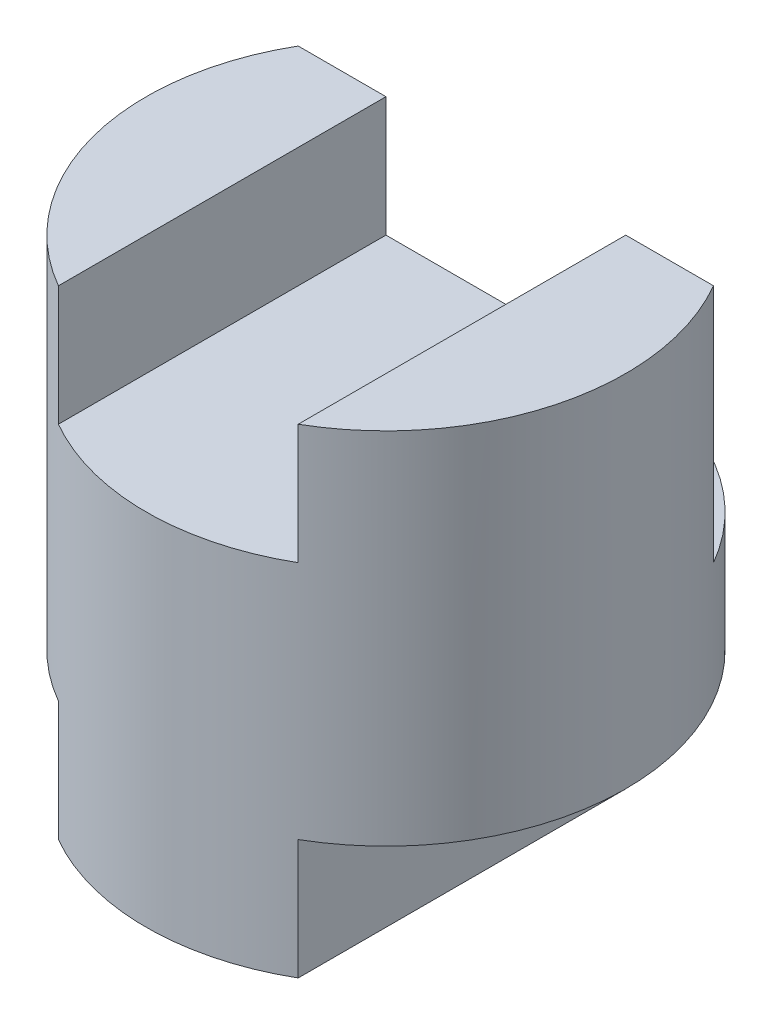
ISO-10303-21;
HEADER;
FILE_DESCRIPTION(('STEP AP214'),'2;1');
FILE_NAME('part.step','',(''),(''),'','','');
FILE_SCHEMA(('AUTOMOTIVE_DESIGN { 1 0 10303 214 1 1 1 1 }'));
ENDSEC;
DATA;
#1=APPLICATION_CONTEXT('core data for automotive mechanical design processes');
#2=APPLICATION_PROTOCOL_DEFINITION('international standard','automotive_design',2000,#1);
#3=PRODUCT_CONTEXT('',#1,'mechanical');
#4=PRODUCT('Part','Part','',(#3));
#5=PRODUCT_RELATED_PRODUCT_CATEGORY('part','',(#4));
#6=PRODUCT_DEFINITION_FORMATION('','',#4);
#7=PRODUCT_DEFINITION_CONTEXT('part definition',#1,'design');
#8=PRODUCT_DEFINITION('design','',#6,#7);
#9=PRODUCT_DEFINITION_SHAPE('','',#8);
#10=(LENGTH_UNIT() NAMED_UNIT(*) SI_UNIT(.MILLI.,.METRE.));
#11=(NAMED_UNIT(*) PLANE_ANGLE_UNIT() SI_UNIT($,.RADIAN.));
#12=(NAMED_UNIT(*) SI_UNIT($,.STERADIAN.) SOLID_ANGLE_UNIT());
#13=UNCERTAINTY_MEASURE_WITH_UNIT(LENGTH_MEASURE(1.E-05),#10,'distance_accuracy_value','');
#14=(GEOMETRIC_REPRESENTATION_CONTEXT(3) GLOBAL_UNCERTAINTY_ASSIGNED_CONTEXT((#13)) GLOBAL_UNIT_ASSIGNED_CONTEXT((#10,
#11,#12)) REPRESENTATION_CONTEXT('',''));
#15=CARTESIAN_POINT('',(0.,0.,0.));
#16=DIRECTION('',(0.,0.,1.));
#17=DIRECTION('',(1.,0.,0.));
#18=AXIS2_PLACEMENT_3D('',#15,#16,#17);
#19=CARTESIAN_POINT('',(0.,4.,0.));
#20=DIRECTION('',(0.,-1.,0.));
#21=DIRECTION('',(0.,0.,-1.));
#22=AXIS2_PLACEMENT_3D('',#19,#20,#21);
#23=CYLINDRICAL_SURFACE('',#22,2.);
#24=CARTESIAN_POINT('',(0.,4.,0.));
#25=DIRECTION('',(0.,1.,0.));
#26=DIRECTION('',(0.,0.,1.));
#27=AXIS2_PLACEMENT_3D('',#24,#25,#26);
#28=CIRCLE('',#27,2.);
#29=CARTESIAN_POINT('',(-1.73205080756888,4.,-1.));
#30=VERTEX_POINT('',#29);
#31=CARTESIAN_POINT('',(-1.,4.,1.73205080756888));
#32=VERTEX_POINT('',#31);
#33=EDGE_CURVE('E166',#30,#32,#28,.T.);
#34=ORIENTED_EDGE('',*,*,#33,.F.);
#35=DIRECTION('',(0.,1.,0.));
#36=VECTOR('',#35,1.);
#37=CARTESIAN_POINT('',(-1.73205080756888,2.,-1.));
#38=LINE('',#37,#36);
#39=CARTESIAN_POINT('',(-1.73205080756888,2.,-1.));
#40=VERTEX_POINT('',#39);
#41=EDGE_CURVE('E190',#40,#30,#38,.T.);
#42=ORIENTED_EDGE('',*,*,#41,.F.);
#43=CARTESIAN_POINT('',(0.,2.,0.));
#44=DIRECTION('',(0.,1.,0.));
#45=DIRECTION('',(0.,0.,-1.));
#46=AXIS2_PLACEMENT_3D('',#43,#44,#45);
#47=CIRCLE('',#46,2.);
#48=CARTESIAN_POINT('',(1.73205080756888,2.,-1.));
#49=VERTEX_POINT('',#48);
#50=EDGE_CURVE('E184',#49,#40,#47,.T.);
#51=ORIENTED_EDGE('',*,*,#50,.F.);
#52=DIRECTION('',(0.,1.,0.));
#53=VECTOR('',#52,1.);
#54=CARTESIAN_POINT('',(1.73205080756888,2.,-1.));
#55=LINE('',#54,#53);
#56=CARTESIAN_POINT('',(1.73205080756888,4.,-1.));
#57=VERTEX_POINT('',#56);
#58=EDGE_CURVE('E165',#49,#57,#55,.T.);
#59=ORIENTED_EDGE('',*,*,#58,.T.);
#60=CARTESIAN_POINT('',(1.,4.,1.73205080756888));
#61=VERTEX_POINT('',#60);
#62=EDGE_CURVE('E134',#61,#57,#28,.T.);
#63=ORIENTED_EDGE('',*,*,#62,.F.);
#64=DIRECTION('',(0.,-1.,0.));
#65=VECTOR('',#64,1.);
#66=CARTESIAN_POINT('',(1.,4.,1.73205080756888));
#67=LINE('',#66,#65);
#68=CARTESIAN_POINT('',(1.,3.,1.73205080756888));
#69=VERTEX_POINT('',#68);
#70=EDGE_CURVE('E156',#69,#61,#67,.F.);
#71=ORIENTED_EDGE('',*,*,#70,.F.);
#72=CARTESIAN_POINT('',(0.,3.,0.));
#73=DIRECTION('',(0.,1.,0.));
#74=DIRECTION('',(-1.,0.,0.));
#75=AXIS2_PLACEMENT_3D('',#72,#73,#74);
#76=CIRCLE('',#75,2.);
#77=CARTESIAN_POINT('',(-1.,3.,1.73205080756888));
#78=VERTEX_POINT('',#77);
#79=EDGE_CURVE('E142',#78,#69,#76,.T.);
#80=ORIENTED_EDGE('',*,*,#79,.F.);
#81=DIRECTION('',(0.,-1.,0.));
#82=VECTOR('',#81,1.);
#83=CARTESIAN_POINT('',(-1.,4.,1.73205080756888));
#84=LINE('',#83,#82);
#85=EDGE_CURVE('E160',#78,#32,#84,.F.);
#86=ORIENTED_EDGE('',*,*,#85,.T.);
#87=EDGE_LOOP('',(#34,#42,#51,#59,#63,#71,#80,#86));
#88=FACE_BOUND('',#87,.T.);
#89=DIRECTION('',(0.,-1.,0.));
#90=VECTOR('',#89,1.);
#91=CARTESIAN_POINT('',(1.,4.,1.73205080756888));
#92=LINE('',#91,#90);
#93=CARTESIAN_POINT('',(1.,1.,1.73205080756888));
#94=VERTEX_POINT('',#93);
#95=CARTESIAN_POINT('',(1.,0.,1.73205080756888));
#96=VERTEX_POINT('',#95);
#97=EDGE_CURVE('E130',#94,#96,#92,.T.);
#98=ORIENTED_EDGE('',*,*,#97,.F.);
#99=CARTESIAN_POINT('',(0.,1.,0.));
#100=DIRECTION('',(0.,-1.,0.));
#101=DIRECTION('',(0.,0.,-1.));
#102=AXIS2_PLACEMENT_3D('',#99,#100,#101);
#103=CIRCLE('',#102,2.);
#104=CARTESIAN_POINT('',(-1.,1.,1.73205080756888));
#105=VERTEX_POINT('',#104);
#106=EDGE_CURVE('E140',#105,#94,#103,.T.);
#107=ORIENTED_EDGE('',*,*,#106,.F.);
#108=DIRECTION('',(0.,-1.,0.));
#109=VECTOR('',#108,1.);
#110=CARTESIAN_POINT('',(-1.,4.,1.73205080756888));
#111=LINE('',#110,#109);
#112=CARTESIAN_POINT('',(-1.,0.,1.73205080756888));
#113=VERTEX_POINT('',#112);
#114=EDGE_CURVE('E200',#105,#113,#111,.T.);
#115=ORIENTED_EDGE('',*,*,#114,.T.);
#116=CARTESIAN_POINT('',(0.,0.,0.));
#117=DIRECTION('',(0.,1.,0.));
#118=DIRECTION('',(0.,0.,1.));
#119=AXIS2_PLACEMENT_3D('',#116,#117,#118);
#120=CIRCLE('',#119,2.);
#121=EDGE_CURVE('E168',#113,#96,#120,.T.);
#122=ORIENTED_EDGE('',*,*,#121,.T.);
#123=EDGE_LOOP('',(#98,#107,#115,#122));
#124=FACE_BOUND('',#123,.T.);
#125=ADVANCED_FACE('F33',(#88,#124),#23,.T.);
#126=CARTESIAN_POINT('',(0.,4.,0.));
#127=DIRECTION('',(0.,1.,0.));
#128=DIRECTION('',(0.,0.,1.));
#129=AXIS2_PLACEMENT_3D('',#126,#127,#128);
#130=PLANE('',#129);
#131=DIRECTION('',(1.,0.,0.));
#132=VECTOR('',#131,1.);
#133=CARTESIAN_POINT('',(1.73205080756888,4.,-1.));
#134=LINE('',#133,#132);
#135=CARTESIAN_POINT('',(1.,4.,-1.));
#136=VERTEX_POINT('',#135);
#137=EDGE_CURVE('E145',#136,#57,#134,.T.);
#138=ORIENTED_EDGE('',*,*,#137,.F.);
#139=DIRECTION('',(0.,0.,1.));
#140=VECTOR('',#139,1.);
#141=CARTESIAN_POINT('',(1.,4.,0.));
#142=LINE('',#141,#140);
#143=EDGE_CURVE('E55',#136,#61,#142,.T.);
#144=ORIENTED_EDGE('',*,*,#143,.T.);
#145=ORIENTED_EDGE('',*,*,#62,.T.);
#146=EDGE_LOOP('',(#138,#144,#145));
#147=FACE_BOUND('',#146,.T.);
#148=ADVANCED_FACE('F149',(#147),#130,.T.);
#149=CARTESIAN_POINT('',(0.,0.,0.));
#150=DIRECTION('',(0.,1.,0.));
#151=DIRECTION('',(0.,0.,1.));
#152=AXIS2_PLACEMENT_3D('',#149,#150,#151);
#153=PLANE('',#152);
#154=DIRECTION('',(0.,0.,-1.));
#155=VECTOR('',#154,1.);
#156=CARTESIAN_POINT('',(-1.,0.,0.));
#157=LINE('',#156,#155);
#158=CARTESIAN_POINT('',(-1.,0.,-1.));
#159=VERTEX_POINT('',#158);
#160=EDGE_CURVE('E126',#113,#159,#157,.T.);
#161=ORIENTED_EDGE('',*,*,#160,.T.);
#162=DIRECTION('',(-1.,0.,0.));
#163=VECTOR('',#162,1.);
#164=CARTESIAN_POINT('',(1.73205080756888,0.,-1.));
#165=LINE('',#164,#163);
#166=CARTESIAN_POINT('',(1.,0.,-1.));
#167=VERTEX_POINT('',#166);
#168=EDGE_CURVE('E111',#167,#159,#165,.T.);
#169=ORIENTED_EDGE('',*,*,#168,.F.);
#170=DIRECTION('',(0.,0.,-1.));
#171=VECTOR('',#170,1.);
#172=CARTESIAN_POINT('',(1.,0.,0.));
#173=LINE('',#172,#171);
#174=EDGE_CURVE('E124',#96,#167,#173,.T.);
#175=ORIENTED_EDGE('',*,*,#174,.F.);
#176=ORIENTED_EDGE('',*,*,#121,.F.);
#177=EDGE_LOOP('',(#161,#169,#175,#176));
#178=FACE_BOUND('',#177,.T.);
#179=ADVANCED_FACE('F122',(#178),#153,.F.);
#180=CARTESIAN_POINT('',(-1.,4.,-1.));
#181=VERTEX_POINT('',#180);
#182=EDGE_CURVE('E151',#30,#181,#134,.T.);
#183=ORIENTED_EDGE('',*,*,#182,.F.);
#184=ORIENTED_EDGE('',*,*,#33,.T.);
#185=DIRECTION('',(0.,0.,1.));
#186=VECTOR('',#185,1.);
#187=CARTESIAN_POINT('',(-1.,4.,0.));
#188=LINE('',#187,#186);
#189=EDGE_CURVE('E132',#181,#32,#188,.T.);
#190=ORIENTED_EDGE('',*,*,#189,.F.);
#191=EDGE_LOOP('',(#183,#184,#190));
#192=FACE_BOUND('',#191,.T.);
#193=ADVANCED_FACE('F183',(#192),#130,.T.);
#194=CARTESIAN_POINT('',(-1.,0.,-5.));
#195=DIRECTION('',(1.,0.,0.));
#196=DIRECTION('',(0.,0.,-1.));
#197=AXIS2_PLACEMENT_3D('',#194,#195,#196);
#198=PLANE('',#197);
#199=DIRECTION('',(0.,0.,1.));
#200=VECTOR('',#199,1.);
#201=CARTESIAN_POINT('',(-1.,1.,-5.));
#202=LINE('',#201,#200);
#203=CARTESIAN_POINT('',(-1.,1.,-1.));
#204=VERTEX_POINT('',#203);
#205=EDGE_CURVE('E196',#204,#105,#202,.T.);
#206=ORIENTED_EDGE('',*,*,#205,.F.);
#207=DIRECTION('',(0.,-1.,0.));
#208=VECTOR('',#207,1.);
#209=CARTESIAN_POINT('',(-1.,0.,-1.));
#210=LINE('',#209,#208);
#211=EDGE_CURVE('E152',#204,#159,#210,.T.);
#212=ORIENTED_EDGE('',*,*,#211,.T.);
#213=ORIENTED_EDGE('',*,*,#160,.F.);
#214=ORIENTED_EDGE('',*,*,#114,.F.);
#215=EDGE_LOOP('',(#206,#212,#213,#214));
#216=FACE_BOUND('',#215,.T.);
#217=ADVANCED_FACE('F206',(#216),#198,.F.);
#218=CARTESIAN_POINT('',(1.,1.,-5.));
#219=DIRECTION('',(0.,-1.,0.));
#220=DIRECTION('',(0.,0.,-1.));
#221=AXIS2_PLACEMENT_3D('',#218,#219,#220);
#222=PLANE('',#221);
#223=DIRECTION('',(0.,0.,1.));
#224=VECTOR('',#223,1.);
#225=CARTESIAN_POINT('',(1.,1.,-5.));
#226=LINE('',#225,#224);
#227=CARTESIAN_POINT('',(1.,1.,-1.));
#228=VERTEX_POINT('',#227);
#229=EDGE_CURVE('E194',#228,#94,#226,.T.);
#230=ORIENTED_EDGE('',*,*,#229,.F.);
#231=DIRECTION('',(-1.,0.,0.));
#232=VECTOR('',#231,1.);
#233=CARTESIAN_POINT('',(1.73205080756888,1.,-1.));
#234=LINE('',#233,#232);
#235=EDGE_CURVE('E114',#228,#204,#234,.T.);
#236=ORIENTED_EDGE('',*,*,#235,.T.);
#237=ORIENTED_EDGE('',*,*,#205,.T.);
#238=ORIENTED_EDGE('',*,*,#106,.T.);
#239=EDGE_LOOP('',(#230,#236,#237,#238));
#240=FACE_BOUND('',#239,.T.);
#241=ADVANCED_FACE('F210',(#240),#222,.T.);
#242=CARTESIAN_POINT('',(1.,0.,-5.));
#243=DIRECTION('',(1.,0.,0.));
#244=DIRECTION('',(0.,0.,-1.));
#245=AXIS2_PLACEMENT_3D('',#242,#243,#244);
#246=PLANE('',#245);
#247=DIRECTION('',(0.,-1.,0.));
#248=VECTOR('',#247,1.);
#249=CARTESIAN_POINT('',(1.,0.,-1.));
#250=LINE('',#249,#248);
#251=EDGE_CURVE('E11',#228,#167,#250,.T.);
#252=ORIENTED_EDGE('',*,*,#251,.F.);
#253=ORIENTED_EDGE('',*,*,#229,.T.);
#254=ORIENTED_EDGE('',*,*,#97,.T.);
#255=ORIENTED_EDGE('',*,*,#174,.T.);
#256=EDGE_LOOP('',(#252,#253,#254,#255));
#257=FACE_BOUND('',#256,.T.);
#258=ADVANCED_FACE('F128',(#257),#246,.T.);
#259=CARTESIAN_POINT('',(1.,3.,-5.));
#260=DIRECTION('',(0.,1.,0.));
#261=DIRECTION('',(-1.,0.,0.));
#262=AXIS2_PLACEMENT_3D('',#259,#260,#261);
#263=PLANE('',#262);
#264=DIRECTION('',(1.,0.,0.));
#265=VECTOR('',#264,1.);
#266=CARTESIAN_POINT('',(1.,3.,-1.));
#267=LINE('',#266,#265);
#268=CARTESIAN_POINT('',(-1.,3.,-1.));
#269=VERTEX_POINT('',#268);
#270=CARTESIAN_POINT('',(1.,3.,-1.));
#271=VERTEX_POINT('',#270);
#272=EDGE_CURVE('E47',#269,#271,#267,.T.);
#273=ORIENTED_EDGE('',*,*,#272,.F.);
#274=DIRECTION('',(0.,0.,1.));
#275=VECTOR('',#274,1.);
#276=CARTESIAN_POINT('',(-1.,3.,-5.));
#277=LINE('',#276,#275);
#278=EDGE_CURVE('E178',#269,#78,#277,.T.);
#279=ORIENTED_EDGE('',*,*,#278,.T.);
#280=ORIENTED_EDGE('',*,*,#79,.T.);
#281=DIRECTION('',(0.,0.,1.));
#282=VECTOR('',#281,1.);
#283=CARTESIAN_POINT('',(1.,3.,-5.));
#284=LINE('',#283,#282);
#285=EDGE_CURVE('E157',#271,#69,#284,.T.);
#286=ORIENTED_EDGE('',*,*,#285,.F.);
#287=EDGE_LOOP('',(#273,#279,#280,#286));
#288=FACE_BOUND('',#287,.T.);
#289=ADVANCED_FACE('F217',(#288),#263,.T.);
#290=CARTESIAN_POINT('',(-1.,4.,-5.));
#291=DIRECTION('',(-1.,0.,0.));
#292=DIRECTION('',(0.,0.,1.));
#293=AXIS2_PLACEMENT_3D('',#290,#291,#292);
#294=PLANE('',#293);
#295=ORIENTED_EDGE('',*,*,#278,.F.);
#296=DIRECTION('',(0.,1.,0.));
#297=VECTOR('',#296,1.);
#298=CARTESIAN_POINT('',(-1.,4.,-1.));
#299=LINE('',#298,#297);
#300=EDGE_CURVE('E180',#269,#181,#299,.T.);
#301=ORIENTED_EDGE('',*,*,#300,.T.);
#302=ORIENTED_EDGE('',*,*,#189,.T.);
#303=ORIENTED_EDGE('',*,*,#85,.F.);
#304=EDGE_LOOP('',(#295,#301,#302,#303));
#305=FACE_BOUND('',#304,.T.);
#306=ADVANCED_FACE('F176',(#305),#294,.F.);
#307=CARTESIAN_POINT('',(1.,4.,-5.));
#308=DIRECTION('',(-1.,0.,0.));
#309=DIRECTION('',(0.,0.,1.));
#310=AXIS2_PLACEMENT_3D('',#307,#308,#309);
#311=PLANE('',#310);
#312=DIRECTION('',(0.,1.,0.));
#313=VECTOR('',#312,1.);
#314=CARTESIAN_POINT('',(1.,4.,-1.));
#315=LINE('',#314,#313);
#316=EDGE_CURVE('E40',#271,#136,#315,.T.);
#317=ORIENTED_EDGE('',*,*,#316,.F.);
#318=ORIENTED_EDGE('',*,*,#285,.T.);
#319=ORIENTED_EDGE('',*,*,#70,.T.);
#320=ORIENTED_EDGE('',*,*,#143,.F.);
#321=EDGE_LOOP('',(#317,#318,#319,#320));
#322=FACE_BOUND('',#321,.T.);
#323=ADVANCED_FACE('F154',(#322),#311,.T.);
#324=CARTESIAN_POINT('',(1.73205080756888,2.,-1.));
#325=DIRECTION('',(0.,0.,1.));
#326=DIRECTION('',(1.,0.,0.));
#327=AXIS2_PLACEMENT_3D('',#324,#325,#326);
#328=PLANE('',#327);
#329=ORIENTED_EDGE('',*,*,#272,.T.);
#330=ORIENTED_EDGE('',*,*,#316,.T.);
#331=ORIENTED_EDGE('',*,*,#137,.T.);
#332=ORIENTED_EDGE('',*,*,#58,.F.);
#333=DIRECTION('',(1.,0.,0.));
#334=VECTOR('',#333,1.);
#335=CARTESIAN_POINT('',(1.73205080756888,2.,-1.));
#336=LINE('',#335,#334);
#337=EDGE_CURVE('E185',#40,#49,#336,.T.);
#338=ORIENTED_EDGE('',*,*,#337,.F.);
#339=ORIENTED_EDGE('',*,*,#41,.T.);
#340=ORIENTED_EDGE('',*,*,#182,.T.);
#341=ORIENTED_EDGE('',*,*,#300,.F.);
#342=EDGE_LOOP('',(#329,#330,#331,#332,#338,#339,#340,#341));
#343=FACE_BOUND('',#342,.T.);
#344=ADVANCED_FACE('F144',(#343),#328,.F.);
#345=CARTESIAN_POINT('',(0.,2.,0.));
#346=DIRECTION('',(0.,-1.,0.));
#347=DIRECTION('',(0.,0.,-1.));
#348=AXIS2_PLACEMENT_3D('',#345,#346,#347);
#349=PLANE('',#348);
#350=ORIENTED_EDGE('',*,*,#50,.T.);
#351=ORIENTED_EDGE('',*,*,#337,.T.);
#352=EDGE_LOOP('',(#350,#351));
#353=FACE_BOUND('',#352,.T.);
#354=ADVANCED_FACE('F264',(#353),#349,.F.);
#355=CARTESIAN_POINT('',(1.73205080756888,1.,-1.));
#356=DIRECTION('',(0.,0.,1.));
#357=DIRECTION('',(1.,0.,0.));
#358=AXIS2_PLACEMENT_3D('',#355,#356,#357);
#359=PLANE('',#358);
#360=ORIENTED_EDGE('',*,*,#235,.F.);
#361=ORIENTED_EDGE('',*,*,#251,.T.);
#362=ORIENTED_EDGE('',*,*,#168,.T.);
#363=ORIENTED_EDGE('',*,*,#211,.F.);
#364=EDGE_LOOP('',(#360,#361,#362,#363));
#365=FACE_BOUND('',#364,.T.);
#366=ADVANCED_FACE('F110',(#365),#359,.F.);
#367=CLOSED_SHELL('',(#125,#148,#179,#193,#217,#241,#258,#289,#306,#323,#344,#354,#366));
#368=MANIFOLD_SOLID_BREP('B2',#367);
#369=ADVANCED_BREP_SHAPE_REPRESENTATION('',(#18,#368),#14);
#370=SHAPE_DEFINITION_REPRESENTATION(#9,#369);
ENDSEC;
END-ISO-10303-21;
